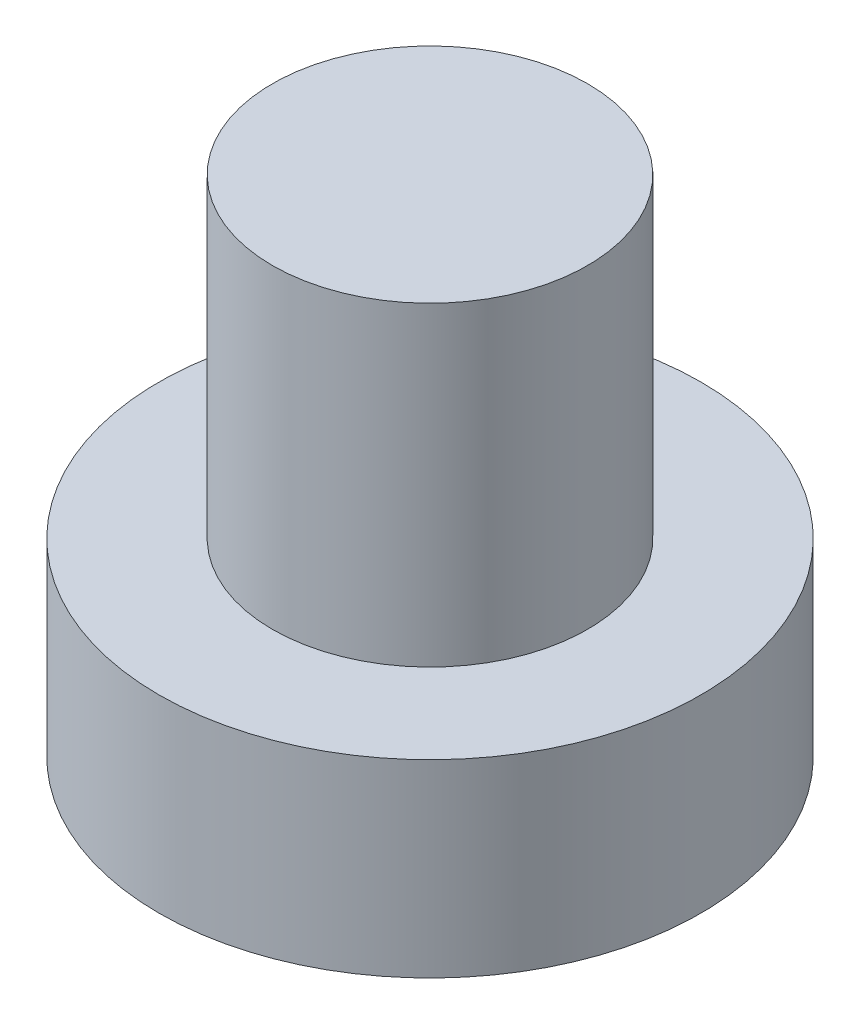
ISO-10303-21;
HEADER;
FILE_DESCRIPTION(('STEP AP214'),'2;1');
FILE_NAME('part.step','',(''),(''),'','','');
FILE_SCHEMA(('AUTOMOTIVE_DESIGN { 1 0 10303 214 1 1 1 1 }'));
ENDSEC;
DATA;
#1=APPLICATION_CONTEXT('core data for automotive mechanical design processes');
#2=APPLICATION_PROTOCOL_DEFINITION('international standard','automotive_design',2000,#1);
#3=PRODUCT_CONTEXT('',#1,'mechanical');
#4=PRODUCT('Part','Part','',(#3));
#5=PRODUCT_RELATED_PRODUCT_CATEGORY('part','',(#4));
#6=PRODUCT_DEFINITION_FORMATION('','',#4);
#7=PRODUCT_DEFINITION_CONTEXT('part definition',#1,'design');
#8=PRODUCT_DEFINITION('design','',#6,#7);
#9=PRODUCT_DEFINITION_SHAPE('','',#8);
#10=(LENGTH_UNIT() NAMED_UNIT(*) SI_UNIT(.MILLI.,.METRE.));
#11=(NAMED_UNIT(*) PLANE_ANGLE_UNIT() SI_UNIT($,.RADIAN.));
#12=(NAMED_UNIT(*) SI_UNIT($,.STERADIAN.) SOLID_ANGLE_UNIT());
#13=UNCERTAINTY_MEASURE_WITH_UNIT(LENGTH_MEASURE(1.E-05),#10,'distance_accuracy_value','');
#14=(GEOMETRIC_REPRESENTATION_CONTEXT(3) GLOBAL_UNCERTAINTY_ASSIGNED_CONTEXT((#13)) GLOBAL_UNIT_ASSIGNED_CONTEXT((#10,
#11,#12)) REPRESENTATION_CONTEXT('',''));
#15=CARTESIAN_POINT('',(0.,0.,0.));
#16=DIRECTION('',(0.,0.,1.));
#17=DIRECTION('',(1.,0.,0.));
#18=AXIS2_PLACEMENT_3D('',#15,#16,#17);
#19=CARTESIAN_POINT('',(0.,0.,0.));
#20=DIRECTION('',(0.,1.,0.));
#21=DIRECTION('',(0.,0.,1.));
#22=AXIS2_PLACEMENT_3D('',#19,#20,#21);
#23=PLANE('',#22);
#24=CARTESIAN_POINT('',(0.,0.,0.));
#25=DIRECTION('',(0.,1.,0.));
#26=DIRECTION('',(0.,0.,1.));
#27=AXIS2_PLACEMENT_3D('',#24,#25,#26);
#28=CIRCLE('',#27,4.3);
#29=CARTESIAN_POINT('',(0.,0.,4.3));
#30=VERTEX_POINT('',#29);
#31=EDGE_CURVE('E39',#30,#30,#28,.T.);
#32=ORIENTED_EDGE('',*,*,#31,.F.);
#33=EDGE_LOOP('',(#32));
#34=FACE_BOUND('',#33,.T.);
#35=CARTESIAN_POINT('',(1.1,0.,1.1));
#36=DIRECTION('',(0.,1.,0.));
#37=DIRECTION('',(0.,0.,-1.));
#38=AXIS2_PLACEMENT_3D('',#35,#36,#37);
#39=CIRCLE('',#38,0.5);
#40=CARTESIAN_POINT('',(1.1,0.,0.6));
#41=VERTEX_POINT('',#40);
#42=CARTESIAN_POINT('',(0.6,0.,1.1));
#43=VERTEX_POINT('',#42);
#44=EDGE_CURVE('E186',#41,#43,#39,.T.);
#45=ORIENTED_EDGE('',*,*,#44,.F.);
#46=DIRECTION('',(-1.,0.,0.));
#47=VECTOR('',#46,1.);
#48=CARTESIAN_POINT('',(1.1,0.,0.6));
#49=LINE('',#48,#47);
#50=CARTESIAN_POINT('',(2.4,0.,0.6));
#51=VERTEX_POINT('',#50);
#52=EDGE_CURVE('E52',#51,#41,#49,.T.);
#53=ORIENTED_EDGE('',*,*,#52,.F.);
#54=DIRECTION('',(0.,0.,1.));
#55=VECTOR('',#54,1.);
#56=CARTESIAN_POINT('',(2.4,0.,-0.6));
#57=LINE('',#56,#55);
#58=CARTESIAN_POINT('',(2.4,0.,-0.6));
#59=VERTEX_POINT('',#58);
#60=EDGE_CURVE('E225',#59,#51,#57,.T.);
#61=ORIENTED_EDGE('',*,*,#60,.F.);
#62=DIRECTION('',(1.,0.,0.));
#63=VECTOR('',#62,1.);
#64=CARTESIAN_POINT('',(1.1,0.,-0.6));
#65=LINE('',#64,#63);
#66=CARTESIAN_POINT('',(1.1,0.,-0.6));
#67=VERTEX_POINT('',#66);
#68=EDGE_CURVE('E223',#67,#59,#65,.T.);
#69=ORIENTED_EDGE('',*,*,#68,.F.);
#70=CARTESIAN_POINT('',(1.1,0.,-1.1));
#71=DIRECTION('',(0.,1.,0.));
#72=DIRECTION('',(0.,0.,-1.));
#73=AXIS2_PLACEMENT_3D('',#70,#71,#72);
#74=CIRCLE('',#73,0.5);
#75=CARTESIAN_POINT('',(0.600000000000001,0.,-1.1));
#76=VERTEX_POINT('',#75);
#77=EDGE_CURVE('E160',#76,#67,#74,.T.);
#78=ORIENTED_EDGE('',*,*,#77,.F.);
#79=DIRECTION('',(0.,0.,1.));
#80=VECTOR('',#79,1.);
#81=CARTESIAN_POINT('',(0.600000000000001,0.,-2.4));
#82=LINE('',#81,#80);
#83=CARTESIAN_POINT('',(0.600000000000001,0.,-2.4));
#84=VERTEX_POINT('',#83);
#85=EDGE_CURVE('E219',#84,#76,#82,.T.);
#86=ORIENTED_EDGE('',*,*,#85,.F.);
#87=DIRECTION('',(1.,0.,0.));
#88=VECTOR('',#87,1.);
#89=CARTESIAN_POINT('',(-0.599999999999999,0.,-2.4));
#90=LINE('',#89,#88);
#91=CARTESIAN_POINT('',(-0.599999999999999,0.,-2.4));
#92=VERTEX_POINT('',#91);
#93=EDGE_CURVE('E216',#92,#84,#90,.T.);
#94=ORIENTED_EDGE('',*,*,#93,.F.);
#95=DIRECTION('',(0.,0.,-1.));
#96=VECTOR('',#95,1.);
#97=CARTESIAN_POINT('',(-0.599999999999999,0.,-2.4));
#98=LINE('',#97,#96);
#99=CARTESIAN_POINT('',(-0.599999999999999,0.,-1.1));
#100=VERTEX_POINT('',#99);
#101=EDGE_CURVE('E213',#100,#92,#98,.T.);
#102=ORIENTED_EDGE('',*,*,#101,.F.);
#103=CARTESIAN_POINT('',(-1.1,0.,-1.1));
#104=DIRECTION('',(0.,1.,0.));
#105=DIRECTION('',(0.,0.,-1.));
#106=AXIS2_PLACEMENT_3D('',#103,#104,#105);
#107=CIRCLE('',#106,0.5);
#108=CARTESIAN_POINT('',(-1.1,0.,-0.6));
#109=VERTEX_POINT('',#108);
#110=EDGE_CURVE('E210',#109,#100,#107,.T.);
#111=ORIENTED_EDGE('',*,*,#110,.F.);
#112=DIRECTION('',(1.,0.,0.));
#113=VECTOR('',#112,1.);
#114=CARTESIAN_POINT('',(-2.4,0.,-0.6));
#115=LINE('',#114,#113);
#116=CARTESIAN_POINT('',(-2.4,0.,-0.6));
#117=VERTEX_POINT('',#116);
#118=EDGE_CURVE('E207',#117,#109,#115,.T.);
#119=ORIENTED_EDGE('',*,*,#118,.F.);
#120=DIRECTION('',(0.,0.,-1.));
#121=VECTOR('',#120,1.);
#122=CARTESIAN_POINT('',(-2.4,0.,-0.6));
#123=LINE('',#122,#121);
#124=CARTESIAN_POINT('',(-2.4,0.,0.6));
#125=VERTEX_POINT('',#124);
#126=EDGE_CURVE('E204',#125,#117,#123,.T.);
#127=ORIENTED_EDGE('',*,*,#126,.F.);
#128=DIRECTION('',(-1.,0.,0.));
#129=VECTOR('',#128,1.);
#130=CARTESIAN_POINT('',(-2.4,0.,0.6));
#131=LINE('',#130,#129);
#132=CARTESIAN_POINT('',(-1.1,0.,0.6));
#133=VERTEX_POINT('',#132);
#134=EDGE_CURVE('E201',#133,#125,#131,.T.);
#135=ORIENTED_EDGE('',*,*,#134,.F.);
#136=CARTESIAN_POINT('',(-1.1,0.,1.1));
#137=DIRECTION('',(0.,1.,0.));
#138=DIRECTION('',(0.,0.,1.));
#139=AXIS2_PLACEMENT_3D('',#136,#137,#138);
#140=CIRCLE('',#139,0.5);
#141=CARTESIAN_POINT('',(-0.599999999999999,0.,1.1));
#142=VERTEX_POINT('',#141);
#143=EDGE_CURVE('E198',#142,#133,#140,.T.);
#144=ORIENTED_EDGE('',*,*,#143,.F.);
#145=DIRECTION('',(0.,0.,-1.));
#146=VECTOR('',#145,1.);
#147=CARTESIAN_POINT('',(-0.599999999999999,0.,1.1));
#148=LINE('',#147,#146);
#149=CARTESIAN_POINT('',(-0.599999999999999,0.,2.4));
#150=VERTEX_POINT('',#149);
#151=EDGE_CURVE('E195',#150,#142,#148,.T.);
#152=ORIENTED_EDGE('',*,*,#151,.F.);
#153=DIRECTION('',(-1.,0.,0.));
#154=VECTOR('',#153,1.);
#155=CARTESIAN_POINT('',(-0.599999999999999,0.,2.4));
#156=LINE('',#155,#154);
#157=CARTESIAN_POINT('',(0.600000000000001,0.,2.4));
#158=VERTEX_POINT('',#157);
#159=EDGE_CURVE('E192',#158,#150,#156,.T.);
#160=ORIENTED_EDGE('',*,*,#159,.F.);
#161=DIRECTION('',(0.,0.,1.));
#162=VECTOR('',#161,1.);
#163=CARTESIAN_POINT('',(0.6,0.,1.1));
#164=LINE('',#163,#162);
#165=EDGE_CURVE('E189',#43,#158,#164,.T.);
#166=ORIENTED_EDGE('',*,*,#165,.F.);
#167=EDGE_LOOP('',(#45,#53,#61,#69,#78,#86,#94,#102,#111,#119,#127,#135,#144,#152,#160,#166));
#168=FACE_BOUND('',#167,.T.);
#169=ADVANCED_FACE('F35',(#34,#168),#23,.F.);
#170=CARTESIAN_POINT('',(0.,3.,0.));
#171=DIRECTION('',(0.,-1.,0.));
#172=DIRECTION('',(0.,0.,-1.));
#173=AXIS2_PLACEMENT_3D('',#170,#171,#172);
#174=CYLINDRICAL_SURFACE('',#173,4.3);
#175=CARTESIAN_POINT('',(0.,3.,0.));
#176=DIRECTION('',(0.,1.,0.));
#177=DIRECTION('',(0.,0.,1.));
#178=AXIS2_PLACEMENT_3D('',#175,#176,#177);
#179=CIRCLE('',#178,4.3);
#180=CARTESIAN_POINT('',(0.,3.,4.3));
#181=VERTEX_POINT('',#180);
#182=EDGE_CURVE('E44',#181,#181,#179,.T.);
#183=ORIENTED_EDGE('',*,*,#182,.F.);
#184=EDGE_LOOP('',(#183));
#185=FACE_BOUND('',#184,.T.);
#186=ORIENTED_EDGE('',*,*,#31,.T.);
#187=EDGE_LOOP('',(#186));
#188=FACE_BOUND('',#187,.T.);
#189=ADVANCED_FACE('F37',(#185,#188),#174,.T.);
#190=CARTESIAN_POINT('',(0.,3.,0.));
#191=DIRECTION('',(0.,1.,0.));
#192=DIRECTION('',(0.,0.,1.));
#193=AXIS2_PLACEMENT_3D('',#190,#191,#192);
#194=PLANE('',#193);
#195=CARTESIAN_POINT('',(0.,3.,0.));
#196=DIRECTION('',(0.,1.,0.));
#197=DIRECTION('',(0.,0.,1.));
#198=AXIS2_PLACEMENT_3D('',#195,#196,#197);
#199=CIRCLE('',#198,2.5);
#200=CARTESIAN_POINT('',(0.,3.,2.5));
#201=VERTEX_POINT('',#200);
#202=EDGE_CURVE('E11',#201,#201,#199,.T.);
#203=ORIENTED_EDGE('',*,*,#202,.F.);
#204=EDGE_LOOP('',(#203));
#205=FACE_BOUND('',#204,.T.);
#206=ORIENTED_EDGE('',*,*,#182,.T.);
#207=EDGE_LOOP('',(#206));
#208=FACE_BOUND('',#207,.T.);
#209=ADVANCED_FACE('F374',(#205,#208),#194,.T.);
#210=CARTESIAN_POINT('',(0.,8.,0.));
#211=DIRECTION('',(0.,-1.,0.));
#212=DIRECTION('',(0.,0.,-1.));
#213=AXIS2_PLACEMENT_3D('',#210,#211,#212);
#214=CYLINDRICAL_SURFACE('',#213,2.5);
#215=CARTESIAN_POINT('',(0.,8.,0.));
#216=DIRECTION('',(0.,1.,0.));
#217=DIRECTION('',(0.,0.,1.));
#218=AXIS2_PLACEMENT_3D('',#215,#216,#217);
#219=CIRCLE('',#218,2.5);
#220=CARTESIAN_POINT('',(0.,8.,2.5));
#221=VERTEX_POINT('',#220);
#222=EDGE_CURVE('E229',#221,#221,#219,.T.);
#223=ORIENTED_EDGE('',*,*,#222,.F.);
#224=EDGE_LOOP('',(#223));
#225=FACE_BOUND('',#224,.T.);
#226=ORIENTED_EDGE('',*,*,#202,.T.);
#227=EDGE_LOOP('',(#226));
#228=FACE_BOUND('',#227,.T.);
#229=ADVANCED_FACE('F370',(#225,#228),#214,.T.);
#230=CARTESIAN_POINT('',(0.,8.,0.));
#231=DIRECTION('',(0.,1.,0.));
#232=DIRECTION('',(0.,0.,1.));
#233=AXIS2_PLACEMENT_3D('',#230,#231,#232);
#234=PLANE('',#233);
#235=ORIENTED_EDGE('',*,*,#222,.T.);
#236=EDGE_LOOP('',(#235));
#237=FACE_BOUND('',#236,.T.);
#238=ADVANCED_FACE('F320',(#237),#234,.T.);
#239=CARTESIAN_POINT('',(1.1,1.5,0.6));
#240=DIRECTION('',(0.,0.,1.));
#241=DIRECTION('',(1.,0.,0.));
#242=AXIS2_PLACEMENT_3D('',#239,#240,#241);
#243=PLANE('',#242);
#244=ORIENTED_EDGE('',*,*,#52,.T.);
#245=DIRECTION('',(0.,-1.,0.));
#246=VECTOR('',#245,1.);
#247=CARTESIAN_POINT('',(1.1,1.5,0.6));
#248=LINE('',#247,#246);
#249=CARTESIAN_POINT('',(1.1,1.5,0.6));
#250=VERTEX_POINT('',#249);
#251=EDGE_CURVE('E112',#250,#41,#248,.T.);
#252=ORIENTED_EDGE('',*,*,#251,.F.);
#253=DIRECTION('',(-1.,0.,0.));
#254=VECTOR('',#253,1.);
#255=CARTESIAN_POINT('',(1.1,1.5,0.6));
#256=LINE('',#255,#254);
#257=CARTESIAN_POINT('',(2.4,1.5,0.6));
#258=VERTEX_POINT('',#257);
#259=EDGE_CURVE('E227',#258,#250,#256,.T.);
#260=ORIENTED_EDGE('',*,*,#259,.F.);
#261=DIRECTION('',(0.,-1.,0.));
#262=VECTOR('',#261,1.);
#263=CARTESIAN_POINT('',(2.4,1.5,0.6));
#264=LINE('',#263,#262);
#265=EDGE_CURVE('E60',#258,#51,#264,.T.);
#266=ORIENTED_EDGE('',*,*,#265,.T.);
#267=EDGE_LOOP('',(#244,#252,#260,#266));
#268=FACE_BOUND('',#267,.T.);
#269=ADVANCED_FACE('F313',(#268),#243,.F.);
#270=CARTESIAN_POINT('',(2.4,1.5,-0.6));
#271=DIRECTION('',(1.,0.,0.));
#272=DIRECTION('',(0.,0.,-1.));
#273=AXIS2_PLACEMENT_3D('',#270,#271,#272);
#274=PLANE('',#273);
#275=ORIENTED_EDGE('',*,*,#60,.T.);
#276=ORIENTED_EDGE('',*,*,#265,.F.);
#277=DIRECTION('',(0.,0.,1.));
#278=VECTOR('',#277,1.);
#279=CARTESIAN_POINT('',(2.4,1.5,-0.6));
#280=LINE('',#279,#278);
#281=CARTESIAN_POINT('',(2.4,1.5,-0.6));
#282=VERTEX_POINT('',#281);
#283=EDGE_CURVE('E172',#282,#258,#280,.T.);
#284=ORIENTED_EDGE('',*,*,#283,.F.);
#285=DIRECTION('',(0.,-1.,0.));
#286=VECTOR('',#285,1.);
#287=CARTESIAN_POINT('',(2.4,1.5,-0.6));
#288=LINE('',#287,#286);
#289=EDGE_CURVE('E164',#282,#59,#288,.T.);
#290=ORIENTED_EDGE('',*,*,#289,.T.);
#291=EDGE_LOOP('',(#275,#276,#284,#290));
#292=FACE_BOUND('',#291,.T.);
#293=ADVANCED_FACE('F311',(#292),#274,.F.);
#294=CARTESIAN_POINT('',(1.1,1.5,-0.6));
#295=DIRECTION('',(0.,0.,-1.));
#296=DIRECTION('',(-1.,0.,0.));
#297=AXIS2_PLACEMENT_3D('',#294,#295,#296);
#298=PLANE('',#297);
#299=ORIENTED_EDGE('',*,*,#68,.T.);
#300=ORIENTED_EDGE('',*,*,#289,.F.);
#301=DIRECTION('',(1.,0.,0.));
#302=VECTOR('',#301,1.);
#303=CARTESIAN_POINT('',(1.1,1.5,-0.6));
#304=LINE('',#303,#302);
#305=CARTESIAN_POINT('',(1.1,1.5,-0.6));
#306=VERTEX_POINT('',#305);
#307=EDGE_CURVE('E168',#306,#282,#304,.T.);
#308=ORIENTED_EDGE('',*,*,#307,.F.);
#309=DIRECTION('',(0.,-1.,0.));
#310=VECTOR('',#309,1.);
#311=CARTESIAN_POINT('',(1.1,1.5,-0.6));
#312=LINE('',#311,#310);
#313=EDGE_CURVE('E153',#306,#67,#312,.T.);
#314=ORIENTED_EDGE('',*,*,#313,.T.);
#315=EDGE_LOOP('',(#299,#300,#308,#314));
#316=FACE_BOUND('',#315,.T.);
#317=ADVANCED_FACE('F169',(#316),#298,.F.);
#318=CARTESIAN_POINT('',(1.1,1.5,-1.1));
#319=DIRECTION('',(0.,-1.,0.));
#320=DIRECTION('',(0.,0.,-1.));
#321=AXIS2_PLACEMENT_3D('',#318,#319,#320);
#322=CYLINDRICAL_SURFACE('',#321,0.5);
#323=ORIENTED_EDGE('',*,*,#77,.T.);
#324=ORIENTED_EDGE('',*,*,#313,.F.);
#325=CARTESIAN_POINT('',(1.1,1.5,-1.1));
#326=DIRECTION('',(0.,1.,0.));
#327=DIRECTION('',(0.,0.,-1.));
#328=AXIS2_PLACEMENT_3D('',#325,#326,#327);
#329=CIRCLE('',#328,0.5);
#330=CARTESIAN_POINT('',(0.600000000000001,1.5,-1.1));
#331=VERTEX_POINT('',#330);
#332=EDGE_CURVE('E157',#331,#306,#329,.T.);
#333=ORIENTED_EDGE('',*,*,#332,.F.);
#334=DIRECTION('',(0.,-1.,0.));
#335=VECTOR('',#334,1.);
#336=CARTESIAN_POINT('',(0.600000000000001,1.5,-1.1));
#337=LINE('',#336,#335);
#338=EDGE_CURVE('E165',#331,#76,#337,.T.);
#339=ORIENTED_EDGE('',*,*,#338,.T.);
#340=EDGE_LOOP('',(#323,#324,#333,#339));
#341=FACE_BOUND('',#340,.T.);
#342=ADVANCED_FACE('F155',(#341),#322,.T.);
#343=CARTESIAN_POINT('',(0.600000000000001,1.5,-2.4));
#344=DIRECTION('',(1.,0.,0.));
#345=DIRECTION('',(0.,0.,-1.));
#346=AXIS2_PLACEMENT_3D('',#343,#344,#345);
#347=PLANE('',#346);
#348=ORIENTED_EDGE('',*,*,#85,.T.);
#349=ORIENTED_EDGE('',*,*,#338,.F.);
#350=DIRECTION('',(0.,0.,1.));
#351=VECTOR('',#350,1.);
#352=CARTESIAN_POINT('',(0.600000000000001,1.5,-2.4));
#353=LINE('',#352,#351);
#354=CARTESIAN_POINT('',(0.600000000000001,1.5,-2.4));
#355=VERTEX_POINT('',#354);
#356=EDGE_CURVE('E178',#355,#331,#353,.T.);
#357=ORIENTED_EDGE('',*,*,#356,.F.);
#358=DIRECTION('',(0.,-1.,0.));
#359=VECTOR('',#358,1.);
#360=CARTESIAN_POINT('',(0.600000000000001,1.5,-2.4));
#361=LINE('',#360,#359);
#362=EDGE_CURVE('E232',#355,#84,#361,.T.);
#363=ORIENTED_EDGE('',*,*,#362,.T.);
#364=EDGE_LOOP('',(#348,#349,#357,#363));
#365=FACE_BOUND('',#364,.T.);
#366=ADVANCED_FACE('F310',(#365),#347,.F.);
#367=CARTESIAN_POINT('',(-0.599999999999999,1.5,-2.4));
#368=DIRECTION('',(0.,0.,-1.));
#369=DIRECTION('',(-1.,0.,0.));
#370=AXIS2_PLACEMENT_3D('',#367,#368,#369);
#371=PLANE('',#370);
#372=ORIENTED_EDGE('',*,*,#93,.T.);
#373=ORIENTED_EDGE('',*,*,#362,.F.);
#374=DIRECTION('',(1.,0.,0.));
#375=VECTOR('',#374,1.);
#376=CARTESIAN_POINT('',(-0.599999999999999,1.5,-2.4));
#377=LINE('',#376,#375);
#378=CARTESIAN_POINT('',(-0.599999999999999,1.5,-2.4));
#379=VERTEX_POINT('',#378);
#380=EDGE_CURVE('E180',#379,#355,#377,.T.);
#381=ORIENTED_EDGE('',*,*,#380,.F.);
#382=DIRECTION('',(0.,-1.,0.));
#383=VECTOR('',#382,1.);
#384=CARTESIAN_POINT('',(-0.599999999999999,1.5,-2.4));
#385=LINE('',#384,#383);
#386=EDGE_CURVE('E234',#379,#92,#385,.T.);
#387=ORIENTED_EDGE('',*,*,#386,.T.);
#388=EDGE_LOOP('',(#372,#373,#381,#387));
#389=FACE_BOUND('',#388,.T.);
#390=ADVANCED_FACE('F306',(#389),#371,.F.);
#391=CARTESIAN_POINT('',(-0.599999999999999,1.5,-2.4));
#392=DIRECTION('',(-1.,0.,0.));
#393=DIRECTION('',(0.,0.,1.));
#394=AXIS2_PLACEMENT_3D('',#391,#392,#393);
#395=PLANE('',#394);
#396=ORIENTED_EDGE('',*,*,#101,.T.);
#397=ORIENTED_EDGE('',*,*,#386,.F.);
#398=DIRECTION('',(0.,0.,-1.));
#399=VECTOR('',#398,1.);
#400=CARTESIAN_POINT('',(-0.599999999999999,1.5,-2.4));
#401=LINE('',#400,#399);
#402=CARTESIAN_POINT('',(-0.599999999999999,1.5,-1.1));
#403=VERTEX_POINT('',#402);
#404=EDGE_CURVE('E301',#403,#379,#401,.T.);
#405=ORIENTED_EDGE('',*,*,#404,.F.);
#406=DIRECTION('',(0.,-1.,0.));
#407=VECTOR('',#406,1.);
#408=CARTESIAN_POINT('',(-0.599999999999999,1.5,-1.1));
#409=LINE('',#408,#407);
#410=EDGE_CURVE('E236',#403,#100,#409,.T.);
#411=ORIENTED_EDGE('',*,*,#410,.T.);
#412=EDGE_LOOP('',(#396,#397,#405,#411));
#413=FACE_BOUND('',#412,.T.);
#414=ADVANCED_FACE('F330',(#413),#395,.F.);
#415=CARTESIAN_POINT('',(-1.1,1.5,-1.1));
#416=DIRECTION('',(0.,-1.,0.));
#417=DIRECTION('',(0.,0.,-1.));
#418=AXIS2_PLACEMENT_3D('',#415,#416,#417);
#419=CYLINDRICAL_SURFACE('',#418,0.5);
#420=ORIENTED_EDGE('',*,*,#110,.T.);
#421=ORIENTED_EDGE('',*,*,#410,.F.);
#422=CARTESIAN_POINT('',(-1.1,1.5,-1.1));
#423=DIRECTION('',(0.,1.,0.));
#424=DIRECTION('',(0.,0.,-1.));
#425=AXIS2_PLACEMENT_3D('',#422,#423,#424);
#426=CIRCLE('',#425,0.5);
#427=CARTESIAN_POINT('',(-1.1,1.5,-0.6));
#428=VERTEX_POINT('',#427);
#429=EDGE_CURVE('E298',#428,#403,#426,.T.);
#430=ORIENTED_EDGE('',*,*,#429,.F.);
#431=DIRECTION('',(0.,-1.,0.));
#432=VECTOR('',#431,1.);
#433=CARTESIAN_POINT('',(-1.1,1.5,-0.6));
#434=LINE('',#433,#432);
#435=EDGE_CURVE('E238',#428,#109,#434,.T.);
#436=ORIENTED_EDGE('',*,*,#435,.T.);
#437=EDGE_LOOP('',(#420,#421,#430,#436));
#438=FACE_BOUND('',#437,.T.);
#439=ADVANCED_FACE('F333',(#438),#419,.T.);
#440=CARTESIAN_POINT('',(-2.4,1.5,-0.6));
#441=DIRECTION('',(0.,0.,-1.));
#442=DIRECTION('',(-1.,0.,0.));
#443=AXIS2_PLACEMENT_3D('',#440,#441,#442);
#444=PLANE('',#443);
#445=ORIENTED_EDGE('',*,*,#118,.T.);
#446=ORIENTED_EDGE('',*,*,#435,.F.);
#447=DIRECTION('',(1.,0.,0.));
#448=VECTOR('',#447,1.);
#449=CARTESIAN_POINT('',(-2.4,1.5,-0.6));
#450=LINE('',#449,#448);
#451=CARTESIAN_POINT('',(-2.4,1.5,-0.6));
#452=VERTEX_POINT('',#451);
#453=EDGE_CURVE('E295',#452,#428,#450,.T.);
#454=ORIENTED_EDGE('',*,*,#453,.F.);
#455=DIRECTION('',(0.,-1.,0.));
#456=VECTOR('',#455,1.);
#457=CARTESIAN_POINT('',(-2.4,1.5,-0.6));
#458=LINE('',#457,#456);
#459=EDGE_CURVE('E240',#452,#117,#458,.T.);
#460=ORIENTED_EDGE('',*,*,#459,.T.);
#461=EDGE_LOOP('',(#445,#446,#454,#460));
#462=FACE_BOUND('',#461,.T.);
#463=ADVANCED_FACE('F337',(#462),#444,.F.);
#464=CARTESIAN_POINT('',(-2.4,1.5,-0.6));
#465=DIRECTION('',(-1.,0.,0.));
#466=DIRECTION('',(0.,0.,1.));
#467=AXIS2_PLACEMENT_3D('',#464,#465,#466);
#468=PLANE('',#467);
#469=ORIENTED_EDGE('',*,*,#126,.T.);
#470=ORIENTED_EDGE('',*,*,#459,.F.);
#471=DIRECTION('',(0.,0.,-1.));
#472=VECTOR('',#471,1.);
#473=CARTESIAN_POINT('',(-2.4,1.5,-0.6));
#474=LINE('',#473,#472);
#475=CARTESIAN_POINT('',(-2.4,1.5,0.6));
#476=VERTEX_POINT('',#475);
#477=EDGE_CURVE('E292',#476,#452,#474,.T.);
#478=ORIENTED_EDGE('',*,*,#477,.F.);
#479=DIRECTION('',(0.,-1.,0.));
#480=VECTOR('',#479,1.);
#481=CARTESIAN_POINT('',(-2.4,1.5,0.6));
#482=LINE('',#481,#480);
#483=EDGE_CURVE('E242',#476,#125,#482,.T.);
#484=ORIENTED_EDGE('',*,*,#483,.T.);
#485=EDGE_LOOP('',(#469,#470,#478,#484));
#486=FACE_BOUND('',#485,.T.);
#487=ADVANCED_FACE('F341',(#486),#468,.F.);
#488=CARTESIAN_POINT('',(-2.4,1.5,0.6));
#489=DIRECTION('',(0.,0.,1.));
#490=DIRECTION('',(1.,0.,0.));
#491=AXIS2_PLACEMENT_3D('',#488,#489,#490);
#492=PLANE('',#491);
#493=ORIENTED_EDGE('',*,*,#134,.T.);
#494=ORIENTED_EDGE('',*,*,#483,.F.);
#495=DIRECTION('',(-1.,0.,0.));
#496=VECTOR('',#495,1.);
#497=CARTESIAN_POINT('',(-2.4,1.5,0.6));
#498=LINE('',#497,#496);
#499=CARTESIAN_POINT('',(-1.1,1.5,0.6));
#500=VERTEX_POINT('',#499);
#501=EDGE_CURVE('E289',#500,#476,#498,.T.);
#502=ORIENTED_EDGE('',*,*,#501,.F.);
#503=DIRECTION('',(0.,-1.,0.));
#504=VECTOR('',#503,1.);
#505=CARTESIAN_POINT('',(-1.1,1.5,0.6));
#506=LINE('',#505,#504);
#507=EDGE_CURVE('E244',#500,#133,#506,.T.);
#508=ORIENTED_EDGE('',*,*,#507,.T.);
#509=EDGE_LOOP('',(#493,#494,#502,#508));
#510=FACE_BOUND('',#509,.T.);
#511=ADVANCED_FACE('F345',(#510),#492,.F.);
#512=CARTESIAN_POINT('',(-1.1,1.5,1.1));
#513=DIRECTION('',(0.,-1.,0.));
#514=DIRECTION('',(0.,0.,-1.));
#515=AXIS2_PLACEMENT_3D('',#512,#513,#514);
#516=CYLINDRICAL_SURFACE('',#515,0.5);
#517=ORIENTED_EDGE('',*,*,#143,.T.);
#518=ORIENTED_EDGE('',*,*,#507,.F.);
#519=CARTESIAN_POINT('',(-1.1,1.5,1.1));
#520=DIRECTION('',(0.,1.,0.));
#521=DIRECTION('',(0.,0.,1.));
#522=AXIS2_PLACEMENT_3D('',#519,#520,#521);
#523=CIRCLE('',#522,0.5);
#524=CARTESIAN_POINT('',(-0.599999999999999,1.5,1.1));
#525=VERTEX_POINT('',#524);
#526=EDGE_CURVE('E286',#525,#500,#523,.T.);
#527=ORIENTED_EDGE('',*,*,#526,.F.);
#528=DIRECTION('',(0.,-1.,0.));
#529=VECTOR('',#528,1.);
#530=CARTESIAN_POINT('',(-0.599999999999999,1.5,1.1));
#531=LINE('',#530,#529);
#532=EDGE_CURVE('E246',#525,#142,#531,.T.);
#533=ORIENTED_EDGE('',*,*,#532,.T.);
#534=EDGE_LOOP('',(#517,#518,#527,#533));
#535=FACE_BOUND('',#534,.T.);
#536=ADVANCED_FACE('F349',(#535),#516,.T.);
#537=CARTESIAN_POINT('',(-0.599999999999999,1.5,1.1));
#538=DIRECTION('',(-1.,0.,0.));
#539=DIRECTION('',(0.,0.,1.));
#540=AXIS2_PLACEMENT_3D('',#537,#538,#539);
#541=PLANE('',#540);
#542=ORIENTED_EDGE('',*,*,#151,.T.);
#543=ORIENTED_EDGE('',*,*,#532,.F.);
#544=DIRECTION('',(0.,0.,-1.));
#545=VECTOR('',#544,1.);
#546=CARTESIAN_POINT('',(-0.599999999999999,1.5,1.1));
#547=LINE('',#546,#545);
#548=CARTESIAN_POINT('',(-0.599999999999999,1.5,2.4));
#549=VERTEX_POINT('',#548);
#550=EDGE_CURVE('E283',#549,#525,#547,.T.);
#551=ORIENTED_EDGE('',*,*,#550,.F.);
#552=DIRECTION('',(0.,-1.,0.));
#553=VECTOR('',#552,1.);
#554=CARTESIAN_POINT('',(-0.599999999999999,1.5,2.4));
#555=LINE('',#554,#553);
#556=EDGE_CURVE('E248',#549,#150,#555,.T.);
#557=ORIENTED_EDGE('',*,*,#556,.T.);
#558=EDGE_LOOP('',(#542,#543,#551,#557));
#559=FACE_BOUND('',#558,.T.);
#560=ADVANCED_FACE('F353',(#559),#541,.F.);
#561=CARTESIAN_POINT('',(-0.599999999999999,1.5,2.4));
#562=DIRECTION('',(0.,0.,1.));
#563=DIRECTION('',(1.,0.,0.));
#564=AXIS2_PLACEMENT_3D('',#561,#562,#563);
#565=PLANE('',#564);
#566=ORIENTED_EDGE('',*,*,#159,.T.);
#567=ORIENTED_EDGE('',*,*,#556,.F.);
#568=DIRECTION('',(-1.,0.,0.));
#569=VECTOR('',#568,1.);
#570=CARTESIAN_POINT('',(-0.599999999999999,1.5,2.4));
#571=LINE('',#570,#569);
#572=CARTESIAN_POINT('',(0.600000000000001,1.5,2.4));
#573=VERTEX_POINT('',#572);
#574=EDGE_CURVE('E280',#573,#549,#571,.T.);
#575=ORIENTED_EDGE('',*,*,#574,.F.);
#576=DIRECTION('',(0.,-1.,0.));
#577=VECTOR('',#576,1.);
#578=CARTESIAN_POINT('',(0.600000000000001,1.5,2.4));
#579=LINE('',#578,#577);
#580=EDGE_CURVE('E250',#573,#158,#579,.T.);
#581=ORIENTED_EDGE('',*,*,#580,.T.);
#582=EDGE_LOOP('',(#566,#567,#575,#581));
#583=FACE_BOUND('',#582,.T.);
#584=ADVANCED_FACE('F357',(#583),#565,.F.);
#585=CARTESIAN_POINT('',(0.6,1.5,1.1));
#586=DIRECTION('',(1.,0.,0.));
#587=DIRECTION('',(0.,0.,-1.));
#588=AXIS2_PLACEMENT_3D('',#585,#586,#587);
#589=PLANE('',#588);
#590=ORIENTED_EDGE('',*,*,#165,.T.);
#591=ORIENTED_EDGE('',*,*,#580,.F.);
#592=DIRECTION('',(0.,0.,1.));
#593=VECTOR('',#592,1.);
#594=CARTESIAN_POINT('',(0.6,1.5,1.1));
#595=LINE('',#594,#593);
#596=CARTESIAN_POINT('',(0.6,1.5,1.1));
#597=VERTEX_POINT('',#596);
#598=EDGE_CURVE('E275',#597,#573,#595,.T.);
#599=ORIENTED_EDGE('',*,*,#598,.F.);
#600=DIRECTION('',(0.,-1.,0.));
#601=VECTOR('',#600,1.);
#602=CARTESIAN_POINT('',(0.6,1.5,1.1));
#603=LINE('',#602,#601);
#604=EDGE_CURVE('E252',#597,#43,#603,.T.);
#605=ORIENTED_EDGE('',*,*,#604,.T.);
#606=EDGE_LOOP('',(#590,#591,#599,#605));
#607=FACE_BOUND('',#606,.T.);
#608=ADVANCED_FACE('F361',(#607),#589,.F.);
#609=CARTESIAN_POINT('',(1.1,1.5,1.1));
#610=DIRECTION('',(0.,-1.,0.));
#611=DIRECTION('',(0.,0.,-1.));
#612=AXIS2_PLACEMENT_3D('',#609,#610,#611);
#613=CYLINDRICAL_SURFACE('',#612,0.5);
#614=ORIENTED_EDGE('',*,*,#44,.T.);
#615=ORIENTED_EDGE('',*,*,#604,.F.);
#616=CARTESIAN_POINT('',(1.1,1.5,1.1));
#617=DIRECTION('',(0.,1.,0.));
#618=DIRECTION('',(0.,0.,-1.));
#619=AXIS2_PLACEMENT_3D('',#616,#617,#618);
#620=CIRCLE('',#619,0.5);
#621=EDGE_CURVE('E273',#250,#597,#620,.T.);
#622=ORIENTED_EDGE('',*,*,#621,.F.);
#623=ORIENTED_EDGE('',*,*,#251,.T.);
#624=EDGE_LOOP('',(#614,#615,#622,#623));
#625=FACE_BOUND('',#624,.T.);
#626=ADVANCED_FACE('F270',(#625),#613,.T.);
#627=CARTESIAN_POINT('',(1.1,1.5,-1.1));
#628=DIRECTION('',(0.,-1.,0.));
#629=DIRECTION('',(0.,0.,-1.));
#630=AXIS2_PLACEMENT_3D('',#627,#628,#629);
#631=PLANE('',#630);
#632=ORIENTED_EDGE('',*,*,#259,.T.);
#633=ORIENTED_EDGE('',*,*,#621,.T.);
#634=ORIENTED_EDGE('',*,*,#598,.T.);
#635=ORIENTED_EDGE('',*,*,#574,.T.);
#636=ORIENTED_EDGE('',*,*,#550,.T.);
#637=ORIENTED_EDGE('',*,*,#526,.T.);
#638=ORIENTED_EDGE('',*,*,#501,.T.);
#639=ORIENTED_EDGE('',*,*,#477,.T.);
#640=ORIENTED_EDGE('',*,*,#453,.T.);
#641=ORIENTED_EDGE('',*,*,#429,.T.);
#642=ORIENTED_EDGE('',*,*,#404,.T.);
#643=ORIENTED_EDGE('',*,*,#380,.T.);
#644=ORIENTED_EDGE('',*,*,#356,.T.);
#645=ORIENTED_EDGE('',*,*,#332,.T.);
#646=ORIENTED_EDGE('',*,*,#307,.T.);
#647=ORIENTED_EDGE('',*,*,#283,.T.);
#648=EDGE_LOOP('',(#632,#633,#634,#635,#636,#637,#638,#639,#640,#641,#642,#643,#644,#645,#646,#647));
#649=FACE_BOUND('',#648,.T.);
#650=ADVANCED_FACE('F175',(#649),#631,.T.);
#651=CLOSED_SHELL('',(#169,#189,#209,#229,#238,#269,#293,#317,#342,#366,#390,#414,#439,#463,
#487,#511,#536,#560,#584,#608,#626,#650));
#652=MANIFOLD_SOLID_BREP('B2',#651);
#653=ADVANCED_BREP_SHAPE_REPRESENTATION('',(#18,#652),#14);
#654=SHAPE_DEFINITION_REPRESENTATION(#9,#653);
ENDSEC;
END-ISO-10303-21;
